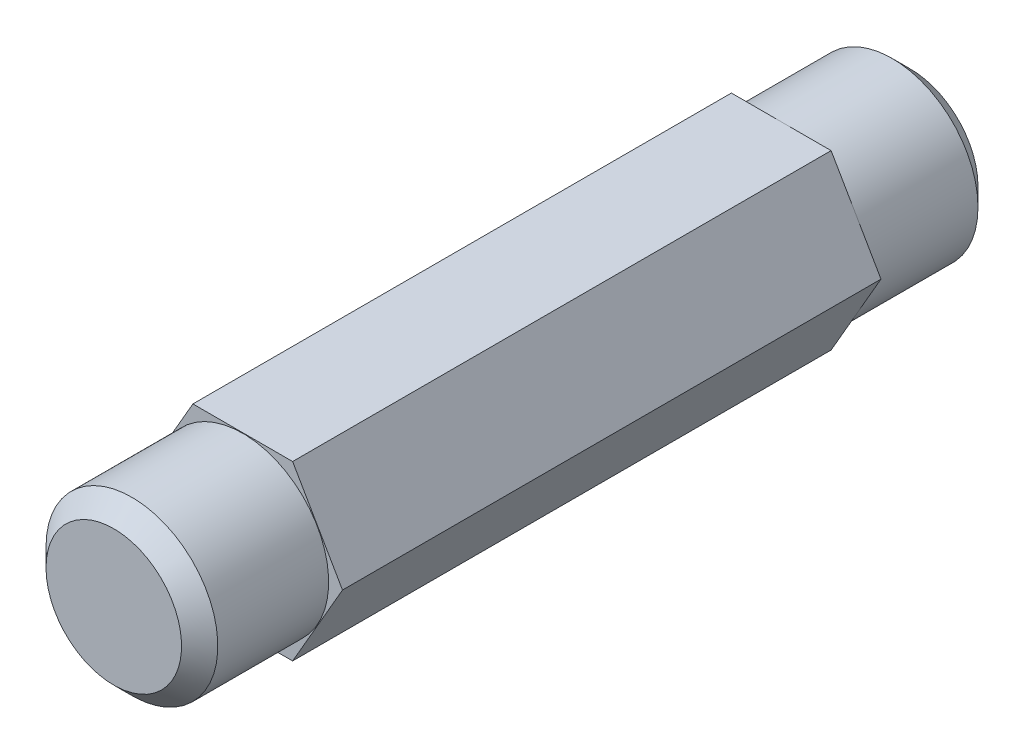
ISO-10303-21;
HEADER;
FILE_DESCRIPTION(('STEP AP214'),'2;1');
FILE_NAME('part.step','',(''),(''),'','','');
FILE_SCHEMA(('AUTOMOTIVE_DESIGN { 1 0 10303 214 1 1 1 1 }'));
ENDSEC;
DATA;
#1=APPLICATION_CONTEXT('core data for automotive mechanical design processes');
#2=APPLICATION_PROTOCOL_DEFINITION('international standard','automotive_design',2000,#1);
#3=PRODUCT_CONTEXT('',#1,'mechanical');
#4=PRODUCT('Part','Part','',(#3));
#5=PRODUCT_RELATED_PRODUCT_CATEGORY('part','',(#4));
#6=PRODUCT_DEFINITION_FORMATION('','',#4);
#7=PRODUCT_DEFINITION_CONTEXT('part definition',#1,'design');
#8=PRODUCT_DEFINITION('design','',#6,#7);
#9=PRODUCT_DEFINITION_SHAPE('','',#8);
#10=(LENGTH_UNIT() NAMED_UNIT(*) SI_UNIT(.MILLI.,.METRE.));
#11=(NAMED_UNIT(*) PLANE_ANGLE_UNIT() SI_UNIT($,.RADIAN.));
#12=(NAMED_UNIT(*) SI_UNIT($,.STERADIAN.) SOLID_ANGLE_UNIT());
#13=UNCERTAINTY_MEASURE_WITH_UNIT(LENGTH_MEASURE(1.E-05),#10,'distance_accuracy_value','');
#14=(GEOMETRIC_REPRESENTATION_CONTEXT(3) GLOBAL_UNCERTAINTY_ASSIGNED_CONTEXT((#13)) GLOBAL_UNIT_ASSIGNED_CONTEXT((#10,
#11,#12)) REPRESENTATION_CONTEXT('',''));
#15=CARTESIAN_POINT('',(0.,0.,0.));
#16=DIRECTION('',(0.,0.,1.));
#17=DIRECTION('',(1.,0.,0.));
#18=AXIS2_PLACEMENT_3D('',#15,#16,#17);
#19=CARTESIAN_POINT('',(0.,0.,21.9583));
#20=DIRECTION('',(0.,0.,1.));
#21=DIRECTION('',(1.,0.,0.));
#22=AXIS2_PLACEMENT_3D('',#19,#20,#21);
#23=PLANE('',#22);
#24=CARTESIAN_POINT('',(0.,0.,21.9583000000512));
#25=DIRECTION('',(0.,0.,-1.));
#26=DIRECTION('',(-1.,0.,0.));
#27=AXIS2_PLACEMENT_3D('',#24,#25,#26);
#28=CIRCLE('',#27,3.73710000002347);
#29=CARTESIAN_POINT('',(-3.73710000002347,0.,21.9583000000512));
#30=VERTEX_POINT('',#29);
#31=EDGE_CURVE('E20',#30,#30,#28,.T.);
#32=ORIENTED_EDGE('',*,*,#31,.F.);
#33=EDGE_LOOP('',(#32));
#34=FACE_BOUND('',#33,.T.);
#35=ADVANCED_FACE('F17',(#34),#23,.T.);
#36=CARTESIAN_POINT('',(0.,0.,-21.9583));
#37=DIRECTION('',(0.,0.,-1.));
#38=DIRECTION('',(-1.,0.,0.));
#39=AXIS2_PLACEMENT_3D('',#36,#37,#38);
#40=PLANE('',#39);
#41=CARTESIAN_POINT('',(0.,0.,-21.9582999999943));
#42=DIRECTION('',(0.,0.,1.));
#43=DIRECTION('',(1.,0.,0.));
#44=AXIS2_PLACEMENT_3D('',#41,#42,#43);
#45=CIRCLE('',#44,3.73710000002347);
#46=CARTESIAN_POINT('',(3.73710000002347,0.,-21.9582999999943));
#47=VERTEX_POINT('',#46);
#48=EDGE_CURVE('E105',#47,#47,#45,.T.);
#49=ORIENTED_EDGE('',*,*,#48,.F.);
#50=EDGE_LOOP('',(#49));
#51=FACE_BOUND('',#50,.T.);
#52=ADVANCED_FACE('F121',(#51),#40,.T.);
#53=CARTESIAN_POINT('',(0.,0.,20.9583000000748));
#54=DIRECTION('',(0.,0.,-1.));
#55=DIRECTION('',(-1.,0.,0.));
#56=AXIS2_PLACEMENT_3D('',#53,#54,#55);
#57=CONICAL_SURFACE('',#56,4.73709999994298,0.785398163369027);
#58=CARTESIAN_POINT('',(0.,0.,20.9583));
#59=DIRECTION('',(0.,0.,-1.));
#60=DIRECTION('',(-1.,0.,0.));
#61=AXIS2_PLACEMENT_3D('',#58,#59,#60);
#62=CIRCLE('',#61,4.7371);
#63=CARTESIAN_POINT('',(-4.7371,0.,20.9583));
#64=VERTEX_POINT('',#63);
#65=EDGE_CURVE('E87',#64,#64,#62,.T.);
#66=ORIENTED_EDGE('',*,*,#65,.F.);
#67=EDGE_LOOP('',(#66));
#68=FACE_BOUND('',#67,.T.);
#69=ORIENTED_EDGE('',*,*,#31,.T.);
#70=EDGE_LOOP('',(#69));
#71=FACE_BOUND('',#70,.T.);
#72=ADVANCED_FACE('F118',(#68,#71),#57,.T.);
#73=CARTESIAN_POINT('',(0.,0.,-20.958300000018));
#74=DIRECTION('',(0.,0.,1.));
#75=DIRECTION('',(1.,0.,0.));
#76=AXIS2_PLACEMENT_3D('',#73,#74,#75);
#77=CONICAL_SURFACE('',#76,4.73710000005667,0.78539816342587);
#78=CARTESIAN_POINT('',(0.,0.,-20.9583));
#79=DIRECTION('',(0.,0.,1.));
#80=DIRECTION('',(1.,0.,0.));
#81=AXIS2_PLACEMENT_3D('',#78,#79,#80);
#82=CIRCLE('',#81,4.7371);
#83=CARTESIAN_POINT('',(4.7371,0.,-20.9583));
#84=VERTEX_POINT('',#83);
#85=EDGE_CURVE('E99',#84,#84,#82,.T.);
#86=ORIENTED_EDGE('',*,*,#85,.F.);
#87=EDGE_LOOP('',(#86));
#88=FACE_BOUND('',#87,.T.);
#89=ORIENTED_EDGE('',*,*,#48,.T.);
#90=EDGE_LOOP('',(#89));
#91=FACE_BOUND('',#90,.T.);
#92=ADVANCED_FACE('F165',(#88,#91),#77,.T.);
#93=CARTESIAN_POINT('',(0.,0.,21.9583));
#94=DIRECTION('',(0.,0.,-1.));
#95=DIRECTION('',(-1.,0.,0.));
#96=AXIS2_PLACEMENT_3D('',#93,#94,#95);
#97=CYLINDRICAL_SURFACE('',#96,4.7371);
#98=CARTESIAN_POINT('',(0.,0.,14.8463000003));
#99=DIRECTION('',(0.,0.,-1.));
#100=DIRECTION('',(-1.,0.,0.));
#101=AXIS2_PLACEMENT_3D('',#98,#99,#100);
#102=CIRCLE('',#101,4.7371);
#103=CARTESIAN_POINT('',(-4.7371,0.,14.8463000003));
#104=VERTEX_POINT('',#103);
#105=EDGE_CURVE('E110',#104,#104,#102,.T.);
#106=ORIENTED_EDGE('',*,*,#105,.F.);
#107=EDGE_LOOP('',(#106));
#108=FACE_BOUND('',#107,.T.);
#109=ORIENTED_EDGE('',*,*,#65,.T.);
#110=EDGE_LOOP('',(#109));
#111=FACE_BOUND('',#110,.T.);
#112=ADVANCED_FACE('F162',(#108,#111),#97,.T.);
#113=CARTESIAN_POINT('',(5.49926131403,0.,14.8463));
#114=DIRECTION('',(-0.866025403784329,-0.50000000000019,0.));
#115=DIRECTION('',(0.50000000000019,-0.866025403784329,0.));
#116=AXIS2_PLACEMENT_3D('',#113,#114,#115);
#117=PLANE('',#116);
#118=DIRECTION('',(0.,0.,-1.));
#119=VECTOR('',#118,1.);
#120=CARTESIAN_POINT('',(2.74963065701,4.7625,14.8463));
#121=LINE('',#120,#119);
#122=CARTESIAN_POINT('',(2.74963065728976,4.76249999952305,-14.84630000045));
#123=VERTEX_POINT('',#122);
#124=CARTESIAN_POINT('',(2.74963065752226,4.76249999933055,14.8463));
#125=VERTEX_POINT('',#124);
#126=EDGE_CURVE('E80',#123,#125,#121,.F.);
#127=ORIENTED_EDGE('',*,*,#126,.T.);
#128=DIRECTION('',(-0.499999999932821,0.866025403823224,0.));
#129=VECTOR('',#128,1.);
#130=CARTESIAN_POINT('',(5.49926131403,0.,14.8463));
#131=LINE('',#130,#129);
#132=CARTESIAN_POINT('',(5.49926131403023,1.11336040661509E-12,14.8463));
#133=VERTEX_POINT('',#132);
#134=EDGE_CURVE('E69',#133,#125,#131,.T.);
#135=ORIENTED_EDGE('',*,*,#134,.F.);
#136=DIRECTION('',(0.,0.,1.));
#137=VECTOR('',#136,1.);
#138=CARTESIAN_POINT('',(5.49926131403524,-3.02362301862757E-12,14.8463));
#139=LINE('',#138,#137);
#140=CARTESIAN_POINT('',(5.49926131403165,6.91806151056671E-12,-14.84630000045));
#141=VERTEX_POINT('',#140);
#142=EDGE_CURVE('E279',#133,#141,#139,.F.);
#143=ORIENTED_EDGE('',*,*,#142,.T.);
#144=DIRECTION('',(-0.50000000000163,0.866025403783498,0.));
#145=VECTOR('',#144,1.);
#146=CARTESIAN_POINT('',(5.49926131404,1.57420743108E-11,-14.8463));
#147=LINE('',#146,#145);
#148=EDGE_CURVE('E82',#141,#123,#147,.T.);
#149=ORIENTED_EDGE('',*,*,#148,.T.);
#150=EDGE_LOOP('',(#127,#135,#143,#149));
#151=FACE_BOUND('',#150,.T.);
#152=ADVANCED_FACE('F81',(#151),#117,.F.);
#153=CARTESIAN_POINT('',(2.74963065702,4.7625,14.8463));
#154=DIRECTION('',(0.,-1.,0.));
#155=DIRECTION('',(0.,0.,-1.));
#156=AXIS2_PLACEMENT_3D('',#153,#154,#155);
#157=PLANE('',#156);
#158=DIRECTION('',(0.,0.,1.));
#159=VECTOR('',#158,1.);
#160=CARTESIAN_POINT('',(-2.7496306570225,4.76249999999567,14.8463));
#161=LINE('',#160,#159);
#162=CARTESIAN_POINT('',(-2.74963065656524,4.76250000000392,-14.84630000045));
#163=VERTEX_POINT('',#162);
#164=CARTESIAN_POINT('',(-2.74963065633812,4.76249999981142,14.8463));
#165=VERTEX_POINT('',#164);
#166=EDGE_CURVE('E86',#163,#165,#161,.T.);
#167=ORIENTED_EDGE('',*,*,#166,.T.);
#168=DIRECTION('',(1.,0.,0.));
#169=VECTOR('',#168,1.);
#170=CARTESIAN_POINT('',(5.49926131403,4.76249999925,14.8463));
#171=LINE('',#170,#169);
#172=EDGE_CURVE('E66',#125,#165,#171,.F.);
#173=ORIENTED_EDGE('',*,*,#172,.F.);
#174=ORIENTED_EDGE('',*,*,#126,.F.);
#175=DIRECTION('',(1.,0.,0.));
#176=VECTOR('',#175,1.);
#177=CARTESIAN_POINT('',(5.49926131403,4.76250000002,-14.8463));
#178=LINE('',#177,#176);
#179=EDGE_CURVE('E282',#123,#163,#178,.F.);
#180=ORIENTED_EDGE('',*,*,#179,.T.);
#181=EDGE_LOOP('',(#167,#173,#174,#180));
#182=FACE_BOUND('',#181,.T.);
#183=ADVANCED_FACE('F89',(#182),#157,.F.);
#184=CARTESIAN_POINT('',(-2.74963065702,4.7625,14.8463));
#185=DIRECTION('',(0.866025403784329,-0.50000000000019,0.));
#186=DIRECTION('',(0.50000000000019,0.866025403784329,0.));
#187=AXIS2_PLACEMENT_3D('',#184,#185,#186);
#188=PLANE('',#187);
#189=DIRECTION('',(0.,0.,1.));
#190=VECTOR('',#189,1.);
#191=CARTESIAN_POINT('',(-5.49926131402568,-7.47525735802163E-12,14.8463));
#192=LINE('',#191,#190);
#193=CARTESIAN_POINT('',(-5.49926131403904,-1.29518636117407E-11,-14.84630000045));
#194=VERTEX_POINT('',#193);
#195=CARTESIAN_POINT('',(-5.49926131404654,-9.01737435396449E-12,14.8463));
#196=VERTEX_POINT('',#195);
#197=EDGE_CURVE('E77',#194,#196,#192,.T.);
#198=ORIENTED_EDGE('',*,*,#197,.T.);
#199=DIRECTION('',(-0.500000000187855,-0.86602540367598,0.));
#200=VECTOR('',#199,1.);
#201=CARTESIAN_POINT('',(-2.74963065611,4.76249999925,14.8463));
#202=LINE('',#201,#200);
#203=EDGE_CURVE('E91',#165,#196,#202,.T.);
#204=ORIENTED_EDGE('',*,*,#203,.F.);
#205=ORIENTED_EDGE('',*,*,#166,.F.);
#206=DIRECTION('',(-0.499999999997998,-0.866025403785595,0.));
#207=VECTOR('',#206,1.);
#208=CARTESIAN_POINT('',(-2.74963065703,4.7625,-14.8463));
#209=LINE('',#208,#207);
#210=EDGE_CURVE('E272',#163,#194,#209,.T.);
#211=ORIENTED_EDGE('',*,*,#210,.T.);
#212=EDGE_LOOP('',(#198,#204,#205,#211));
#213=FACE_BOUND('',#212,.T.);
#214=ADVANCED_FACE('F153',(#213),#188,.F.);
#215=CARTESIAN_POINT('',(0.,0.,-21.9583));
#216=DIRECTION('',(0.,0.,1.));
#217=DIRECTION('',(1.,0.,0.));
#218=AXIS2_PLACEMENT_3D('',#215,#216,#217);
#219=CYLINDRICAL_SURFACE('',#218,4.7371);
#220=CARTESIAN_POINT('',(0.,0.,-14.8463000003));
#221=DIRECTION('',(0.,0.,1.));
#222=DIRECTION('',(1.,0.,0.));
#223=AXIS2_PLACEMENT_3D('',#220,#221,#222);
#224=CIRCLE('',#223,4.7371);
#225=CARTESIAN_POINT('',(4.7371,0.,-14.8463000003));
#226=VERTEX_POINT('',#225);
#227=EDGE_CURVE('E106',#226,#226,#224,.F.);
#228=ORIENTED_EDGE('',*,*,#227,.T.);
#229=EDGE_LOOP('',(#228));
#230=FACE_BOUND('',#229,.T.);
#231=ORIENTED_EDGE('',*,*,#85,.T.);
#232=EDGE_LOOP('',(#231));
#233=FACE_BOUND('',#232,.T.);
#234=ADVANCED_FACE('F149',(#230,#233),#219,.T.);
#235=CARTESIAN_POINT('',(-5.49926131403,0.,14.8463));
#236=DIRECTION('',(0.866025403784329,0.50000000000019,0.));
#237=DIRECTION('',(-0.50000000000019,0.866025403784329,0.));
#238=AXIS2_PLACEMENT_3D('',#235,#236,#237);
#239=PLANE('',#238);
#240=DIRECTION('',(0.,0.,1.));
#241=VECTOR('',#240,1.);
#242=CARTESIAN_POINT('',(-2.74963065701,-4.7625,14.8463));
#243=LINE('',#242,#241);
#244=CARTESIAN_POINT('',(-2.74963065706101,-4.76249999991926,-14.84630000045));
#245=VERTEX_POINT('',#244);
#246=CARTESIAN_POINT('',(-2.74963065683601,-4.76249999972676,14.8463));
#247=VERTEX_POINT('',#246);
#248=EDGE_CURVE('E109',#245,#247,#243,.T.);
#249=ORIENTED_EDGE('',*,*,#248,.T.);
#250=DIRECTION('',(0.500000000187855,-0.86602540367598,0.));
#251=VECTOR('',#250,1.);
#252=CARTESIAN_POINT('',(-5.49926131407,0.,14.8463));
#253=LINE('',#252,#251);
#254=EDGE_CURVE('E93',#196,#247,#253,.T.);
#255=ORIENTED_EDGE('',*,*,#254,.F.);
#256=ORIENTED_EDGE('',*,*,#197,.F.);
#257=DIRECTION('',(0.500000000001629,-0.866025403783498,0.));
#258=VECTOR('',#257,1.);
#259=CARTESIAN_POINT('',(-5.49926131404,-1.57402979539E-11,-14.8463));
#260=LINE('',#259,#258);
#261=EDGE_CURVE('E285',#194,#245,#260,.T.);
#262=ORIENTED_EDGE('',*,*,#261,.T.);
#263=EDGE_LOOP('',(#249,#255,#256,#262));
#264=FACE_BOUND('',#263,.T.);
#265=ADVANCED_FACE('F145',(#264),#239,.F.);
#266=CARTESIAN_POINT('',(5.49926131403,0.,14.8463));
#267=DIRECTION('',(0.,0.,1.));
#268=DIRECTION('',(1.,0.,0.));
#269=AXIS2_PLACEMENT_3D('',#266,#267,#268);
#270=PLANE('',#269);
#271=ORIENTED_EDGE('',*,*,#105,.T.);
#272=EDGE_LOOP('',(#271));
#273=FACE_BOUND('',#272,.T.);
#274=ORIENTED_EDGE('',*,*,#254,.T.);
#275=DIRECTION('',(1.,0.,0.));
#276=VECTOR('',#275,1.);
#277=CARTESIAN_POINT('',(-2.74963065702,-4.7625,14.8463));
#278=LINE('',#277,#276);
#279=CARTESIAN_POINT('',(2.74963065771,-4.762499999625,14.8463));
#280=VERTEX_POINT('',#279);
#281=EDGE_CURVE('E289',#247,#280,#278,.T.);
#282=ORIENTED_EDGE('',*,*,#281,.T.);
#283=DIRECTION('',(-0.50000000000019,-0.866025403784329,0.));
#284=VECTOR('',#283,1.);
#285=CARTESIAN_POINT('',(2.74963065702,-4.7625,14.8463));
#286=LINE('',#285,#284);
#287=EDGE_CURVE('E73',#280,#133,#286,.F.);
#288=ORIENTED_EDGE('',*,*,#287,.T.);
#289=ORIENTED_EDGE('',*,*,#134,.T.);
#290=ORIENTED_EDGE('',*,*,#172,.T.);
#291=ORIENTED_EDGE('',*,*,#203,.T.);
#292=EDGE_LOOP('',(#274,#282,#288,#289,#290,#291));
#293=FACE_BOUND('',#292,.T.);
#294=ADVANCED_FACE('F71',(#273,#293),#270,.T.);
#295=CARTESIAN_POINT('',(2.74963065702,-4.7625,14.8463));
#296=DIRECTION('',(-0.866025403784329,0.50000000000019,0.));
#297=DIRECTION('',(-0.50000000000019,-0.866025403784329,0.));
#298=AXIS2_PLACEMENT_3D('',#295,#296,#297);
#299=PLANE('',#298);
#300=ORIENTED_EDGE('',*,*,#142,.F.);
#301=ORIENTED_EDGE('',*,*,#287,.F.);
#302=DIRECTION('',(0.,0.,1.));
#303=VECTOR('',#302,1.);
#304=CARTESIAN_POINT('',(2.74963065794,-4.7625,14.8463));
#305=LINE('',#304,#303);
#306=CARTESIAN_POINT('',(2.74963065724711,-4.762500000005,-14.84630000045));
#307=VERTEX_POINT('',#306);
#308=EDGE_CURVE('E26',#280,#307,#305,.F.);
#309=ORIENTED_EDGE('',*,*,#308,.T.);
#310=DIRECTION('',(0.499999999999362,0.866025403784807,0.));
#311=VECTOR('',#310,1.);
#312=CARTESIAN_POINT('',(2.74963065702,-4.7625,-14.8463));
#313=LINE('',#312,#311);
#314=EDGE_CURVE('E34',#307,#141,#313,.T.);
#315=ORIENTED_EDGE('',*,*,#314,.T.);
#316=EDGE_LOOP('',(#300,#301,#309,#315));
#317=FACE_BOUND('',#316,.T.);
#318=ADVANCED_FACE('F135',(#317),#299,.F.);
#319=CARTESIAN_POINT('',(5.49926131403,0.,-14.8463));
#320=DIRECTION('',(0.,0.,1.));
#321=DIRECTION('',(1.,0.,0.));
#322=AXIS2_PLACEMENT_3D('',#319,#320,#321);
#323=PLANE('',#322);
#324=ORIENTED_EDGE('',*,*,#227,.F.);
#325=EDGE_LOOP('',(#324));
#326=FACE_BOUND('',#325,.T.);
#327=DIRECTION('',(1.,0.,0.));
#328=VECTOR('',#327,1.);
#329=CARTESIAN_POINT('',(-2.74963065702,-4.7625,-14.8463000006));
#330=LINE('',#329,#328);
#331=EDGE_CURVE('E11',#307,#245,#330,.F.);
#332=ORIENTED_EDGE('',*,*,#331,.T.);
#333=ORIENTED_EDGE('',*,*,#261,.F.);
#334=ORIENTED_EDGE('',*,*,#210,.F.);
#335=ORIENTED_EDGE('',*,*,#179,.F.);
#336=ORIENTED_EDGE('',*,*,#148,.F.);
#337=ORIENTED_EDGE('',*,*,#314,.F.);
#338=EDGE_LOOP('',(#332,#333,#334,#335,#336,#337));
#339=FACE_BOUND('',#338,.T.);
#340=ADVANCED_FACE('F129',(#326,#339),#323,.F.);
#341=CARTESIAN_POINT('',(-2.74963065702,-4.7625,14.8463));
#342=DIRECTION('',(0.,1.,0.));
#343=DIRECTION('',(0.,0.,1.));
#344=AXIS2_PLACEMENT_3D('',#341,#342,#343);
#345=PLANE('',#344);
#346=ORIENTED_EDGE('',*,*,#308,.F.);
#347=ORIENTED_EDGE('',*,*,#281,.F.);
#348=ORIENTED_EDGE('',*,*,#248,.F.);
#349=ORIENTED_EDGE('',*,*,#331,.F.);
#350=EDGE_LOOP('',(#346,#347,#348,#349));
#351=FACE_BOUND('',#350,.T.);
#352=ADVANCED_FACE('F127',(#351),#345,.F.);
#353=CLOSED_SHELL('',(#35,#52,#72,#92,#112,#152,#183,#214,#234,#265,#294,#318,#340,#352));
#354=MANIFOLD_SOLID_BREP('B1',#353);
#355=ADVANCED_BREP_SHAPE_REPRESENTATION('',(#18,#354),#14);
#356=SHAPE_DEFINITION_REPRESENTATION(#9,#355);
ENDSEC;
END-ISO-10303-21;
